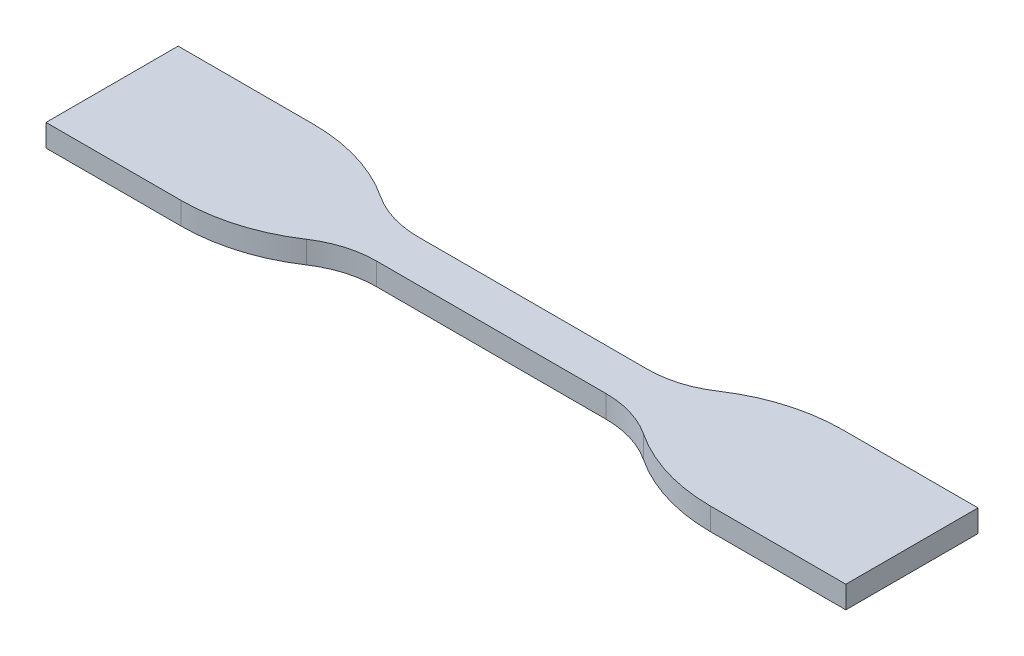
ISO-10303-21;
HEADER;
FILE_DESCRIPTION(('STEP AP214'),'2;1');
FILE_NAME('part.step','',(''),(''),'','','');
FILE_SCHEMA(('AUTOMOTIVE_DESIGN { 1 0 10303 214 1 1 1 1 }'));
ENDSEC;
DATA;
#1=APPLICATION_CONTEXT('core data for automotive mechanical design processes');
#2=APPLICATION_PROTOCOL_DEFINITION('international standard','automotive_design',2000,#1);
#3=PRODUCT_CONTEXT('',#1,'mechanical');
#4=PRODUCT('Part','Part','',(#3));
#5=PRODUCT_RELATED_PRODUCT_CATEGORY('part','',(#4));
#6=PRODUCT_DEFINITION_FORMATION('','',#4);
#7=PRODUCT_DEFINITION_CONTEXT('part definition',#1,'design');
#8=PRODUCT_DEFINITION('design','',#6,#7);
#9=PRODUCT_DEFINITION_SHAPE('','',#8);
#10=(LENGTH_UNIT() NAMED_UNIT(*) SI_UNIT(.MILLI.,.METRE.));
#11=(NAMED_UNIT(*) PLANE_ANGLE_UNIT() SI_UNIT($,.RADIAN.));
#12=(NAMED_UNIT(*) SI_UNIT($,.STERADIAN.) SOLID_ANGLE_UNIT());
#13=UNCERTAINTY_MEASURE_WITH_UNIT(LENGTH_MEASURE(1.E-05),#10,'distance_accuracy_value','');
#14=(GEOMETRIC_REPRESENTATION_CONTEXT(3) GLOBAL_UNCERTAINTY_ASSIGNED_CONTEXT((#13)) GLOBAL_UNIT_ASSIGNED_CONTEXT((#10,
#11,#12)) REPRESENTATION_CONTEXT('',''));
#15=CARTESIAN_POINT('',(0.,0.,0.));
#16=DIRECTION('',(0.,0.,1.));
#17=DIRECTION('',(1.,0.,0.));
#18=AXIS2_PLACEMENT_3D('',#15,#16,#17);
#19=CARTESIAN_POINT('',(57.5,3.2,-9.5));
#20=DIRECTION('',(-1.,0.,0.));
#21=DIRECTION('',(0.,0.,1.));
#22=AXIS2_PLACEMENT_3D('',#19,#20,#21);
#23=PLANE('',#22);
#24=DIRECTION('',(0.,0.,-1.));
#25=VECTOR('',#24,1.);
#26=CARTESIAN_POINT('',(57.5,0.,-9.5));
#27=LINE('',#26,#25);
#28=CARTESIAN_POINT('',(57.5,0.,9.5));
#29=VERTEX_POINT('',#28);
#30=CARTESIAN_POINT('',(57.5,0.,-9.5));
#31=VERTEX_POINT('',#30);
#32=EDGE_CURVE('E177',#29,#31,#27,.T.);
#33=ORIENTED_EDGE('',*,*,#32,.T.);
#34=DIRECTION('',(0.,-1.,0.));
#35=VECTOR('',#34,1.);
#36=CARTESIAN_POINT('',(57.5,3.2,-9.5));
#37=LINE('',#36,#35);
#38=CARTESIAN_POINT('',(57.5,3.2,-9.5));
#39=VERTEX_POINT('',#38);
#40=EDGE_CURVE('E11',#39,#31,#37,.T.);
#41=ORIENTED_EDGE('',*,*,#40,.F.);
#42=DIRECTION('',(0.,0.,-1.));
#43=VECTOR('',#42,1.);
#44=CARTESIAN_POINT('',(57.5,3.2,-9.5));
#45=LINE('',#44,#43);
#46=CARTESIAN_POINT('',(57.5,3.2,9.5));
#47=VERTEX_POINT('',#46);
#48=EDGE_CURVE('E207',#47,#39,#45,.T.);
#49=ORIENTED_EDGE('',*,*,#48,.F.);
#50=DIRECTION('',(0.,-1.,0.));
#51=VECTOR('',#50,1.);
#52=CARTESIAN_POINT('',(57.5,3.2,9.5));
#53=LINE('',#52,#51);
#54=EDGE_CURVE('E173',#47,#29,#53,.T.);
#55=ORIENTED_EDGE('',*,*,#54,.T.);
#56=EDGE_LOOP('',(#33,#41,#49,#55));
#57=FACE_BOUND('',#56,.T.);
#58=ADVANCED_FACE('F33',(#57),#23,.F.);
#59=CARTESIAN_POINT('',(38.0580611373101,3.2,-9.5));
#60=DIRECTION('',(0.,0.,1.));
#61=DIRECTION('',(1.,0.,0.));
#62=AXIS2_PLACEMENT_3D('',#59,#60,#61);
#63=PLANE('',#62);
#64=DIRECTION('',(-1.,0.,0.));
#65=VECTOR('',#64,1.);
#66=CARTESIAN_POINT('',(38.0580611373101,0.,-9.5));
#67=LINE('',#66,#65);
#68=CARTESIAN_POINT('',(38.0580611373101,0.,-9.5));
#69=VERTEX_POINT('',#68);
#70=EDGE_CURVE('E180',#31,#69,#67,.T.);
#71=ORIENTED_EDGE('',*,*,#70,.T.);
#72=DIRECTION('',(0.,-1.,0.));
#73=VECTOR('',#72,1.);
#74=CARTESIAN_POINT('',(38.0580611373101,3.2,-9.5));
#75=LINE('',#74,#73);
#76=CARTESIAN_POINT('',(38.0580611373101,3.2,-9.5));
#77=VERTEX_POINT('',#76);
#78=EDGE_CURVE('E41',#77,#69,#75,.T.);
#79=ORIENTED_EDGE('',*,*,#78,.F.);
#80=DIRECTION('',(-1.,0.,0.));
#81=VECTOR('',#80,1.);
#82=CARTESIAN_POINT('',(38.0580611373101,3.2,-9.5));
#83=LINE('',#82,#81);
#84=EDGE_CURVE('E116',#39,#77,#83,.T.);
#85=ORIENTED_EDGE('',*,*,#84,.F.);
#86=ORIENTED_EDGE('',*,*,#40,.T.);
#87=EDGE_LOOP('',(#71,#79,#85,#86));
#88=FACE_BOUND('',#87,.T.);
#89=ADVANCED_FACE('F305',(#88),#63,.F.);
#90=CARTESIAN_POINT('',(38.0580611373101,3.2,15.5));
#91=DIRECTION('',(0.,-1.,0.));
#92=DIRECTION('',(0.,0.,-1.));
#93=AXIS2_PLACEMENT_3D('',#90,#91,#92);
#94=CYLINDRICAL_SURFACE('',#93,25.);
#95=CARTESIAN_POINT('',(38.0580611373101,0.,15.5));
#96=DIRECTION('',(0.,1.,0.));
#97=DIRECTION('',(0.,0.,-1.));
#98=AXIS2_PLACEMENT_3D('',#95,#96,#97);
#99=CIRCLE('',#98,25.);
#100=CARTESIAN_POINT('',(24.2387911774959,0.,-5.33333333333333));
#101=VERTEX_POINT('',#100);
#102=EDGE_CURVE('E182',#69,#101,#99,.T.);
#103=ORIENTED_EDGE('',*,*,#102,.T.);
#104=DIRECTION('',(0.,-1.,0.));
#105=VECTOR('',#104,1.);
#106=CARTESIAN_POINT('',(24.2387911774959,3.2,-5.33333333333333));
#107=LINE('',#106,#105);
#108=CARTESIAN_POINT('',(24.2387911774959,3.2,-5.33333333333333));
#109=VERTEX_POINT('',#108);
#110=EDGE_CURVE('E238',#109,#101,#107,.T.);
#111=ORIENTED_EDGE('',*,*,#110,.F.);
#112=CARTESIAN_POINT('',(38.0580611373101,3.2,15.5));
#113=DIRECTION('',(0.,1.,0.));
#114=DIRECTION('',(0.,0.,-1.));
#115=AXIS2_PLACEMENT_3D('',#112,#113,#114);
#116=CIRCLE('',#115,25.);
#117=EDGE_CURVE('E246',#77,#109,#116,.T.);
#118=ORIENTED_EDGE('',*,*,#117,.F.);
#119=ORIENTED_EDGE('',*,*,#78,.T.);
#120=EDGE_LOOP('',(#103,#111,#118,#119));
#121=FACE_BOUND('',#120,.T.);
#122=ADVANCED_FACE('F244',(#121),#94,.T.);
#123=CARTESIAN_POINT('',(16.5,3.2,-17.));
#124=DIRECTION('',(0.,-1.,0.));
#125=DIRECTION('',(0.,0.,-1.));
#126=AXIS2_PLACEMENT_3D('',#123,#124,#125);
#127=CYLINDRICAL_SURFACE('',#126,14.);
#128=CARTESIAN_POINT('',(16.5,0.,-17.));
#129=DIRECTION('',(0.,-1.,0.));
#130=DIRECTION('',(0.,0.,1.));
#131=AXIS2_PLACEMENT_3D('',#128,#129,#130);
#132=CIRCLE('',#131,14.);
#133=CARTESIAN_POINT('',(16.5,0.,-3.));
#134=VERTEX_POINT('',#133);
#135=EDGE_CURVE('E184',#101,#134,#132,.T.);
#136=ORIENTED_EDGE('',*,*,#135,.T.);
#137=DIRECTION('',(0.,-1.,0.));
#138=VECTOR('',#137,1.);
#139=CARTESIAN_POINT('',(16.5,3.2,-3.));
#140=LINE('',#139,#138);
#141=CARTESIAN_POINT('',(16.5,3.2,-3.));
#142=VERTEX_POINT('',#141);
#143=EDGE_CURVE('E235',#142,#134,#140,.T.);
#144=ORIENTED_EDGE('',*,*,#143,.F.);
#145=CARTESIAN_POINT('',(16.5,3.2,-17.));
#146=DIRECTION('',(0.,-1.,0.));
#147=DIRECTION('',(0.,0.,1.));
#148=AXIS2_PLACEMENT_3D('',#145,#146,#147);
#149=CIRCLE('',#148,14.);
#150=EDGE_CURVE('E264',#109,#142,#149,.T.);
#151=ORIENTED_EDGE('',*,*,#150,.F.);
#152=ORIENTED_EDGE('',*,*,#110,.T.);
#153=EDGE_LOOP('',(#136,#144,#151,#152));
#154=FACE_BOUND('',#153,.T.);
#155=ADVANCED_FACE('F255',(#154),#127,.F.);
#156=CARTESIAN_POINT('',(-16.5,3.2,-3.));
#157=DIRECTION('',(0.,0.,1.));
#158=DIRECTION('',(1.,0.,0.));
#159=AXIS2_PLACEMENT_3D('',#156,#157,#158);
#160=PLANE('',#159);
#161=DIRECTION('',(-1.,0.,0.));
#162=VECTOR('',#161,1.);
#163=CARTESIAN_POINT('',(-16.5,0.,-3.));
#164=LINE('',#163,#162);
#165=CARTESIAN_POINT('',(-16.5,0.,-3.));
#166=VERTEX_POINT('',#165);
#167=EDGE_CURVE('E186',#134,#166,#164,.T.);
#168=ORIENTED_EDGE('',*,*,#167,.T.);
#169=DIRECTION('',(0.,-1.,0.));
#170=VECTOR('',#169,1.);
#171=CARTESIAN_POINT('',(-16.5,3.2,-3.));
#172=LINE('',#171,#170);
#173=CARTESIAN_POINT('',(-16.5,3.2,-3.));
#174=VERTEX_POINT('',#173);
#175=EDGE_CURVE('E232',#174,#166,#172,.T.);
#176=ORIENTED_EDGE('',*,*,#175,.F.);
#177=DIRECTION('',(-1.,0.,0.));
#178=VECTOR('',#177,1.);
#179=CARTESIAN_POINT('',(-16.5,3.2,-3.));
#180=LINE('',#179,#178);
#181=EDGE_CURVE('E261',#142,#174,#180,.T.);
#182=ORIENTED_EDGE('',*,*,#181,.F.);
#183=ORIENTED_EDGE('',*,*,#143,.T.);
#184=EDGE_LOOP('',(#168,#176,#182,#183));
#185=FACE_BOUND('',#184,.T.);
#186=ADVANCED_FACE('F259',(#185),#160,.F.);
#187=CARTESIAN_POINT('',(-16.5,3.2,-17.));
#188=DIRECTION('',(0.,-1.,0.));
#189=DIRECTION('',(0.,0.,-1.));
#190=AXIS2_PLACEMENT_3D('',#187,#188,#189);
#191=CYLINDRICAL_SURFACE('',#190,14.);
#192=CARTESIAN_POINT('',(-16.5,0.,-17.));
#193=DIRECTION('',(0.,-1.,0.));
#194=DIRECTION('',(0.,0.,-1.));
#195=AXIS2_PLACEMENT_3D('',#192,#193,#194);
#196=CIRCLE('',#195,14.);
#197=CARTESIAN_POINT('',(-24.2387911774959,0.,-5.33333333333334));
#198=VERTEX_POINT('',#197);
#199=EDGE_CURVE('E188',#166,#198,#196,.T.);
#200=ORIENTED_EDGE('',*,*,#199,.T.);
#201=DIRECTION('',(0.,-1.,0.));
#202=VECTOR('',#201,1.);
#203=CARTESIAN_POINT('',(-24.2387911774959,3.2,-5.33333333333334));
#204=LINE('',#203,#202);
#205=CARTESIAN_POINT('',(-24.2387911774959,3.2,-5.33333333333334));
#206=VERTEX_POINT('',#205);
#207=EDGE_CURVE('E229',#206,#198,#204,.T.);
#208=ORIENTED_EDGE('',*,*,#207,.F.);
#209=CARTESIAN_POINT('',(-16.5,3.2,-17.));
#210=DIRECTION('',(0.,-1.,0.));
#211=DIRECTION('',(0.,0.,-1.));
#212=AXIS2_PLACEMENT_3D('',#209,#210,#211);
#213=CIRCLE('',#212,14.);
#214=EDGE_CURVE('E263',#174,#206,#213,.T.);
#215=ORIENTED_EDGE('',*,*,#214,.F.);
#216=ORIENTED_EDGE('',*,*,#175,.T.);
#217=EDGE_LOOP('',(#200,#208,#215,#216));
#218=FACE_BOUND('',#217,.T.);
#219=ADVANCED_FACE('F318',(#218),#191,.F.);
#220=CARTESIAN_POINT('',(-38.0580611373101,3.2,15.5));
#221=DIRECTION('',(0.,-1.,0.));
#222=DIRECTION('',(0.,0.,-1.));
#223=AXIS2_PLACEMENT_3D('',#220,#221,#222);
#224=CYLINDRICAL_SURFACE('',#223,25.);
#225=CARTESIAN_POINT('',(-38.0580611373101,0.,15.5));
#226=DIRECTION('',(0.,1.,0.));
#227=DIRECTION('',(0.,0.,1.));
#228=AXIS2_PLACEMENT_3D('',#225,#226,#227);
#229=CIRCLE('',#228,25.);
#230=CARTESIAN_POINT('',(-38.0580611373101,0.,-9.5));
#231=VERTEX_POINT('',#230);
#232=EDGE_CURVE('E190',#198,#231,#229,.T.);
#233=ORIENTED_EDGE('',*,*,#232,.T.);
#234=DIRECTION('',(0.,-1.,0.));
#235=VECTOR('',#234,1.);
#236=CARTESIAN_POINT('',(-38.0580611373101,3.2,-9.5));
#237=LINE('',#236,#235);
#238=CARTESIAN_POINT('',(-38.0580611373101,3.2,-9.5));
#239=VERTEX_POINT('',#238);
#240=EDGE_CURVE('E226',#239,#231,#237,.T.);
#241=ORIENTED_EDGE('',*,*,#240,.F.);
#242=CARTESIAN_POINT('',(-38.0580611373101,3.2,15.5));
#243=DIRECTION('',(0.,1.,0.));
#244=DIRECTION('',(0.,0.,1.));
#245=AXIS2_PLACEMENT_3D('',#242,#243,#244);
#246=CIRCLE('',#245,25.);
#247=EDGE_CURVE('E266',#206,#239,#246,.T.);
#248=ORIENTED_EDGE('',*,*,#247,.F.);
#249=ORIENTED_EDGE('',*,*,#207,.T.);
#250=EDGE_LOOP('',(#233,#241,#248,#249));
#251=FACE_BOUND('',#250,.T.);
#252=ADVANCED_FACE('F321',(#251),#224,.T.);
#253=CARTESIAN_POINT('',(-57.5,3.2,-9.5));
#254=DIRECTION('',(0.,0.,1.));
#255=DIRECTION('',(1.,0.,0.));
#256=AXIS2_PLACEMENT_3D('',#253,#254,#255);
#257=PLANE('',#256);
#258=DIRECTION('',(-1.,0.,0.));
#259=VECTOR('',#258,1.);
#260=CARTESIAN_POINT('',(-57.5,0.,-9.5));
#261=LINE('',#260,#259);
#262=CARTESIAN_POINT('',(-57.5,0.,-9.5));
#263=VERTEX_POINT('',#262);
#264=EDGE_CURVE('E192',#231,#263,#261,.T.);
#265=ORIENTED_EDGE('',*,*,#264,.T.);
#266=DIRECTION('',(0.,-1.,0.));
#267=VECTOR('',#266,1.);
#268=CARTESIAN_POINT('',(-57.5,3.2,-9.5));
#269=LINE('',#268,#267);
#270=CARTESIAN_POINT('',(-57.5,3.2,-9.5));
#271=VERTEX_POINT('',#270);
#272=EDGE_CURVE('E223',#271,#263,#269,.T.);
#273=ORIENTED_EDGE('',*,*,#272,.F.);
#274=DIRECTION('',(-1.,0.,0.));
#275=VECTOR('',#274,1.);
#276=CARTESIAN_POINT('',(-57.5,3.2,-9.5));
#277=LINE('',#276,#275);
#278=EDGE_CURVE('E272',#239,#271,#277,.T.);
#279=ORIENTED_EDGE('',*,*,#278,.F.);
#280=ORIENTED_EDGE('',*,*,#240,.T.);
#281=EDGE_LOOP('',(#265,#273,#279,#280));
#282=FACE_BOUND('',#281,.T.);
#283=ADVANCED_FACE('F325',(#282),#257,.F.);
#284=CARTESIAN_POINT('',(-57.5,3.2,-9.5));
#285=DIRECTION('',(1.,0.,0.));
#286=DIRECTION('',(0.,0.,-1.));
#287=AXIS2_PLACEMENT_3D('',#284,#285,#286);
#288=PLANE('',#287);
#289=DIRECTION('',(0.,0.,1.));
#290=VECTOR('',#289,1.);
#291=CARTESIAN_POINT('',(-57.5,0.,-9.5));
#292=LINE('',#291,#290);
#293=CARTESIAN_POINT('',(-57.5,0.,9.5));
#294=VERTEX_POINT('',#293);
#295=EDGE_CURVE('E194',#263,#294,#292,.T.);
#296=ORIENTED_EDGE('',*,*,#295,.T.);
#297=DIRECTION('',(0.,-1.,0.));
#298=VECTOR('',#297,1.);
#299=CARTESIAN_POINT('',(-57.5,3.2,9.5));
#300=LINE('',#299,#298);
#301=CARTESIAN_POINT('',(-57.5,3.2,9.5));
#302=VERTEX_POINT('',#301);
#303=EDGE_CURVE('E220',#302,#294,#300,.T.);
#304=ORIENTED_EDGE('',*,*,#303,.F.);
#305=DIRECTION('',(0.,0.,1.));
#306=VECTOR('',#305,1.);
#307=CARTESIAN_POINT('',(-57.5,3.2,-9.5));
#308=LINE('',#307,#306);
#309=EDGE_CURVE('E274',#271,#302,#308,.T.);
#310=ORIENTED_EDGE('',*,*,#309,.F.);
#311=ORIENTED_EDGE('',*,*,#272,.T.);
#312=EDGE_LOOP('',(#296,#304,#310,#311));
#313=FACE_BOUND('',#312,.T.);
#314=ADVANCED_FACE('F329',(#313),#288,.F.);
#315=CARTESIAN_POINT('',(-57.5,3.2,9.5));
#316=DIRECTION('',(0.,0.,-1.));
#317=DIRECTION('',(-1.,0.,0.));
#318=AXIS2_PLACEMENT_3D('',#315,#316,#317);
#319=PLANE('',#318);
#320=DIRECTION('',(1.,0.,0.));
#321=VECTOR('',#320,1.);
#322=CARTESIAN_POINT('',(-57.5,0.,9.5));
#323=LINE('',#322,#321);
#324=CARTESIAN_POINT('',(-38.0580611373101,0.,9.5));
#325=VERTEX_POINT('',#324);
#326=EDGE_CURVE('E196',#294,#325,#323,.T.);
#327=ORIENTED_EDGE('',*,*,#326,.T.);
#328=DIRECTION('',(0.,-1.,0.));
#329=VECTOR('',#328,1.);
#330=CARTESIAN_POINT('',(-38.0580611373101,3.2,9.5));
#331=LINE('',#330,#329);
#332=CARTESIAN_POINT('',(-38.0580611373101,3.2,9.5));
#333=VERTEX_POINT('',#332);
#334=EDGE_CURVE('E217',#333,#325,#331,.T.);
#335=ORIENTED_EDGE('',*,*,#334,.F.);
#336=DIRECTION('',(1.,0.,0.));
#337=VECTOR('',#336,1.);
#338=CARTESIAN_POINT('',(-57.5,3.2,9.5));
#339=LINE('',#338,#337);
#340=EDGE_CURVE('E276',#302,#333,#339,.T.);
#341=ORIENTED_EDGE('',*,*,#340,.F.);
#342=ORIENTED_EDGE('',*,*,#303,.T.);
#343=EDGE_LOOP('',(#327,#335,#341,#342));
#344=FACE_BOUND('',#343,.T.);
#345=ADVANCED_FACE('F333',(#344),#319,.F.);
#346=CARTESIAN_POINT('',(-38.0580611373101,3.2,-15.5));
#347=DIRECTION('',(0.,-1.,0.));
#348=DIRECTION('',(0.,0.,-1.));
#349=AXIS2_PLACEMENT_3D('',#346,#347,#348);
#350=CYLINDRICAL_SURFACE('',#349,25.);
#351=CARTESIAN_POINT('',(-38.0580611373101,0.,-15.5));
#352=DIRECTION('',(0.,1.,0.));
#353=DIRECTION('',(0.,0.,-1.));
#354=AXIS2_PLACEMENT_3D('',#351,#352,#353);
#355=CIRCLE('',#354,25.);
#356=CARTESIAN_POINT('',(-24.2387911774959,0.,5.33333333333333));
#357=VERTEX_POINT('',#356);
#358=EDGE_CURVE('E198',#325,#357,#355,.T.);
#359=ORIENTED_EDGE('',*,*,#358,.T.);
#360=DIRECTION('',(0.,-1.,0.));
#361=VECTOR('',#360,1.);
#362=CARTESIAN_POINT('',(-24.2387911774959,3.2,5.33333333333333));
#363=LINE('',#362,#361);
#364=CARTESIAN_POINT('',(-24.2387911774959,3.2,5.33333333333333));
#365=VERTEX_POINT('',#364);
#366=EDGE_CURVE('E214',#365,#357,#363,.T.);
#367=ORIENTED_EDGE('',*,*,#366,.F.);
#368=CARTESIAN_POINT('',(-38.0580611373101,3.2,-15.5));
#369=DIRECTION('',(0.,1.,0.));
#370=DIRECTION('',(0.,0.,-1.));
#371=AXIS2_PLACEMENT_3D('',#368,#369,#370);
#372=CIRCLE('',#371,25.);
#373=EDGE_CURVE('E278',#333,#365,#372,.T.);
#374=ORIENTED_EDGE('',*,*,#373,.F.);
#375=ORIENTED_EDGE('',*,*,#334,.T.);
#376=EDGE_LOOP('',(#359,#367,#374,#375));
#377=FACE_BOUND('',#376,.T.);
#378=ADVANCED_FACE('F337',(#377),#350,.T.);
#379=CARTESIAN_POINT('',(-16.5,3.2,17.));
#380=DIRECTION('',(0.,-1.,0.));
#381=DIRECTION('',(0.,0.,-1.));
#382=AXIS2_PLACEMENT_3D('',#379,#380,#381);
#383=CYLINDRICAL_SURFACE('',#382,14.);
#384=CARTESIAN_POINT('',(-16.5,0.,17.));
#385=DIRECTION('',(0.,-1.,0.));
#386=DIRECTION('',(0.,0.,1.));
#387=AXIS2_PLACEMENT_3D('',#384,#385,#386);
#388=CIRCLE('',#387,14.);
#389=CARTESIAN_POINT('',(-16.5,0.,3.));
#390=VERTEX_POINT('',#389);
#391=EDGE_CURVE('E200',#357,#390,#388,.T.);
#392=ORIENTED_EDGE('',*,*,#391,.T.);
#393=DIRECTION('',(0.,-1.,0.));
#394=VECTOR('',#393,1.);
#395=CARTESIAN_POINT('',(-16.5,3.2,3.));
#396=LINE('',#395,#394);
#397=CARTESIAN_POINT('',(-16.5,3.2,3.));
#398=VERTEX_POINT('',#397);
#399=EDGE_CURVE('E211',#398,#390,#396,.T.);
#400=ORIENTED_EDGE('',*,*,#399,.F.);
#401=CARTESIAN_POINT('',(-16.5,3.2,17.));
#402=DIRECTION('',(0.,-1.,0.));
#403=DIRECTION('',(0.,0.,1.));
#404=AXIS2_PLACEMENT_3D('',#401,#402,#403);
#405=CIRCLE('',#404,14.);
#406=EDGE_CURVE('E280',#365,#398,#405,.T.);
#407=ORIENTED_EDGE('',*,*,#406,.F.);
#408=ORIENTED_EDGE('',*,*,#366,.T.);
#409=EDGE_LOOP('',(#392,#400,#407,#408));
#410=FACE_BOUND('',#409,.T.);
#411=ADVANCED_FACE('F286',(#410),#383,.F.);
#412=CARTESIAN_POINT('',(-16.5,3.2,3.));
#413=DIRECTION('',(0.,0.,-1.));
#414=DIRECTION('',(-1.,0.,0.));
#415=AXIS2_PLACEMENT_3D('',#412,#413,#414);
#416=PLANE('',#415);
#417=DIRECTION('',(1.,0.,0.));
#418=VECTOR('',#417,1.);
#419=CARTESIAN_POINT('',(-16.5,0.,3.));
#420=LINE('',#419,#418);
#421=CARTESIAN_POINT('',(16.5,0.,3.));
#422=VERTEX_POINT('',#421);
#423=EDGE_CURVE('E202',#390,#422,#420,.T.);
#424=ORIENTED_EDGE('',*,*,#423,.T.);
#425=DIRECTION('',(0.,-1.,0.));
#426=VECTOR('',#425,1.);
#427=CARTESIAN_POINT('',(16.5,3.2,3.));
#428=LINE('',#427,#426);
#429=CARTESIAN_POINT('',(16.5,3.2,3.));
#430=VERTEX_POINT('',#429);
#431=EDGE_CURVE('E168',#430,#422,#428,.T.);
#432=ORIENTED_EDGE('',*,*,#431,.F.);
#433=DIRECTION('',(1.,0.,0.));
#434=VECTOR('',#433,1.);
#435=CARTESIAN_POINT('',(-16.5,3.2,3.));
#436=LINE('',#435,#434);
#437=EDGE_CURVE('E159',#398,#430,#436,.T.);
#438=ORIENTED_EDGE('',*,*,#437,.F.);
#439=ORIENTED_EDGE('',*,*,#399,.T.);
#440=EDGE_LOOP('',(#424,#432,#438,#439));
#441=FACE_BOUND('',#440,.T.);
#442=ADVANCED_FACE('F290',(#441),#416,.F.);
#443=CARTESIAN_POINT('',(16.5,3.2,17.));
#444=DIRECTION('',(0.,-1.,0.));
#445=DIRECTION('',(0.,0.,-1.));
#446=AXIS2_PLACEMENT_3D('',#443,#444,#445);
#447=CYLINDRICAL_SURFACE('',#446,14.);
#448=CARTESIAN_POINT('',(16.5,0.,17.));
#449=DIRECTION('',(0.,-1.,0.));
#450=DIRECTION('',(0.,0.,-1.));
#451=AXIS2_PLACEMENT_3D('',#448,#449,#450);
#452=CIRCLE('',#451,14.);
#453=CARTESIAN_POINT('',(24.2387911774959,0.,5.33333333333333));
#454=VERTEX_POINT('',#453);
#455=EDGE_CURVE('E167',#422,#454,#452,.T.);
#456=ORIENTED_EDGE('',*,*,#455,.T.);
#457=DIRECTION('',(0.,-1.,0.));
#458=VECTOR('',#457,1.);
#459=CARTESIAN_POINT('',(24.2387911774959,3.2,5.33333333333333));
#460=LINE('',#459,#458);
#461=CARTESIAN_POINT('',(24.2387911774959,3.2,5.33333333333333));
#462=VERTEX_POINT('',#461);
#463=EDGE_CURVE('E164',#462,#454,#460,.T.);
#464=ORIENTED_EDGE('',*,*,#463,.F.);
#465=CARTESIAN_POINT('',(16.5,3.2,17.));
#466=DIRECTION('',(0.,-1.,0.));
#467=DIRECTION('',(0.,0.,-1.));
#468=AXIS2_PLACEMENT_3D('',#465,#466,#467);
#469=CIRCLE('',#468,14.);
#470=EDGE_CURVE('E153',#430,#462,#469,.T.);
#471=ORIENTED_EDGE('',*,*,#470,.F.);
#472=ORIENTED_EDGE('',*,*,#431,.T.);
#473=EDGE_LOOP('',(#456,#464,#471,#472));
#474=FACE_BOUND('',#473,.T.);
#475=ADVANCED_FACE('F165',(#474),#447,.F.);
#476=CARTESIAN_POINT('',(38.0580611373101,3.2,-15.5));
#477=DIRECTION('',(0.,-1.,0.));
#478=DIRECTION('',(0.,0.,-1.));
#479=AXIS2_PLACEMENT_3D('',#476,#477,#478);
#480=CYLINDRICAL_SURFACE('',#479,25.);
#481=CARTESIAN_POINT('',(38.0580611373101,0.,-15.5));
#482=DIRECTION('',(0.,1.,0.));
#483=DIRECTION('',(0.,0.,1.));
#484=AXIS2_PLACEMENT_3D('',#481,#482,#483);
#485=CIRCLE('',#484,25.);
#486=CARTESIAN_POINT('',(38.0580611373101,0.,9.5));
#487=VERTEX_POINT('',#486);
#488=EDGE_CURVE('E102',#454,#487,#485,.T.);
#489=ORIENTED_EDGE('',*,*,#488,.T.);
#490=DIRECTION('',(0.,-1.,0.));
#491=VECTOR('',#490,1.);
#492=CARTESIAN_POINT('',(38.0580611373101,3.2,9.5));
#493=LINE('',#492,#491);
#494=CARTESIAN_POINT('',(38.0580611373101,3.2,9.5));
#495=VERTEX_POINT('',#494);
#496=EDGE_CURVE('E169',#495,#487,#493,.T.);
#497=ORIENTED_EDGE('',*,*,#496,.F.);
#498=CARTESIAN_POINT('',(38.0580611373101,3.2,-15.5));
#499=DIRECTION('',(0.,1.,0.));
#500=DIRECTION('',(0.,0.,1.));
#501=AXIS2_PLACEMENT_3D('',#498,#499,#500);
#502=CIRCLE('',#501,25.);
#503=EDGE_CURVE('E157',#462,#495,#502,.T.);
#504=ORIENTED_EDGE('',*,*,#503,.F.);
#505=ORIENTED_EDGE('',*,*,#463,.T.);
#506=EDGE_LOOP('',(#489,#497,#504,#505));
#507=FACE_BOUND('',#506,.T.);
#508=ADVANCED_FACE('F171',(#507),#480,.T.);
#509=CARTESIAN_POINT('',(38.0580611373101,3.2,9.5));
#510=DIRECTION('',(0.,0.,-1.));
#511=DIRECTION('',(-1.,0.,0.));
#512=AXIS2_PLACEMENT_3D('',#509,#510,#511);
#513=PLANE('',#512);
#514=DIRECTION('',(1.,0.,0.));
#515=VECTOR('',#514,1.);
#516=CARTESIAN_POINT('',(38.0580611373101,0.,9.5));
#517=LINE('',#516,#515);
#518=EDGE_CURVE('E108',#487,#29,#517,.T.);
#519=ORIENTED_EDGE('',*,*,#518,.T.);
#520=ORIENTED_EDGE('',*,*,#54,.F.);
#521=DIRECTION('',(1.,0.,0.));
#522=VECTOR('',#521,1.);
#523=CARTESIAN_POINT('',(38.0580611373101,3.2,9.5));
#524=LINE('',#523,#522);
#525=EDGE_CURVE('E49',#495,#47,#524,.T.);
#526=ORIENTED_EDGE('',*,*,#525,.F.);
#527=ORIENTED_EDGE('',*,*,#496,.T.);
#528=EDGE_LOOP('',(#519,#520,#526,#527));
#529=FACE_BOUND('',#528,.T.);
#530=ADVANCED_FACE('F294',(#529),#513,.F.);
#531=CARTESIAN_POINT('',(38.0580611373101,3.2,-15.5));
#532=DIRECTION('',(0.,1.,0.));
#533=DIRECTION('',(0.,0.,1.));
#534=AXIS2_PLACEMENT_3D('',#531,#532,#533);
#535=PLANE('',#534);
#536=ORIENTED_EDGE('',*,*,#48,.T.);
#537=ORIENTED_EDGE('',*,*,#84,.T.);
#538=ORIENTED_EDGE('',*,*,#117,.T.);
#539=ORIENTED_EDGE('',*,*,#150,.T.);
#540=ORIENTED_EDGE('',*,*,#181,.T.);
#541=ORIENTED_EDGE('',*,*,#214,.T.);
#542=ORIENTED_EDGE('',*,*,#247,.T.);
#543=ORIENTED_EDGE('',*,*,#278,.T.);
#544=ORIENTED_EDGE('',*,*,#309,.T.);
#545=ORIENTED_EDGE('',*,*,#340,.T.);
#546=ORIENTED_EDGE('',*,*,#373,.T.);
#547=ORIENTED_EDGE('',*,*,#406,.T.);
#548=ORIENTED_EDGE('',*,*,#437,.T.);
#549=ORIENTED_EDGE('',*,*,#470,.T.);
#550=ORIENTED_EDGE('',*,*,#503,.T.);
#551=ORIENTED_EDGE('',*,*,#525,.T.);
#552=EDGE_LOOP('',(#536,#537,#538,#539,#540,#541,#542,#543,#544,#545,#546,#547,#548,#549,#550,#551));
#553=FACE_BOUND('',#552,.T.);
#554=ADVANCED_FACE('F155',(#553),#535,.T.);
#555=CARTESIAN_POINT('',(38.0580611373101,0.,-15.5));
#556=DIRECTION('',(0.,1.,0.));
#557=DIRECTION('',(0.,0.,1.));
#558=AXIS2_PLACEMENT_3D('',#555,#556,#557);
#559=PLANE('',#558);
#560=ORIENTED_EDGE('',*,*,#32,.F.);
#561=ORIENTED_EDGE('',*,*,#518,.F.);
#562=ORIENTED_EDGE('',*,*,#488,.F.);
#563=ORIENTED_EDGE('',*,*,#455,.F.);
#564=ORIENTED_EDGE('',*,*,#423,.F.);
#565=ORIENTED_EDGE('',*,*,#391,.F.);
#566=ORIENTED_EDGE('',*,*,#358,.F.);
#567=ORIENTED_EDGE('',*,*,#326,.F.);
#568=ORIENTED_EDGE('',*,*,#295,.F.);
#569=ORIENTED_EDGE('',*,*,#264,.F.);
#570=ORIENTED_EDGE('',*,*,#232,.F.);
#571=ORIENTED_EDGE('',*,*,#199,.F.);
#572=ORIENTED_EDGE('',*,*,#167,.F.);
#573=ORIENTED_EDGE('',*,*,#135,.F.);
#574=ORIENTED_EDGE('',*,*,#102,.F.);
#575=ORIENTED_EDGE('',*,*,#70,.F.);
#576=EDGE_LOOP('',(#560,#561,#562,#563,#564,#565,#566,#567,#568,#569,#570,#571,#572,#573,#574,#575));
#577=FACE_BOUND('',#576,.T.);
#578=ADVANCED_FACE('F250',(#577),#559,.F.);
#579=CLOSED_SHELL('',(#58,#89,#122,#155,#186,#219,#252,#283,#314,#345,#378,#411,#442,#475,#508,
#530,#554,#578));
#580=MANIFOLD_SOLID_BREP('B2',#579);
#581=ADVANCED_BREP_SHAPE_REPRESENTATION('',(#18,#580),#14);
#582=SHAPE_DEFINITION_REPRESENTATION(#9,#581);
ENDSEC;
END-ISO-10303-21;
